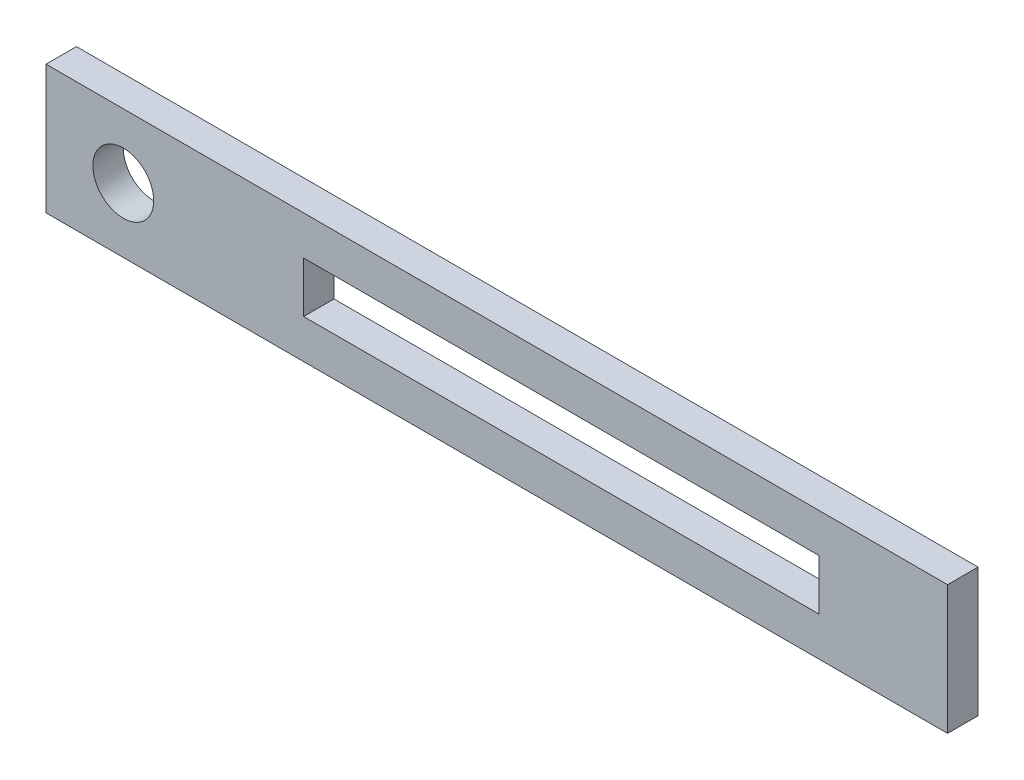
ISO-10303-21;
HEADER;
FILE_DESCRIPTION(('STEP AP214'),'2;1');
FILE_NAME('part.step','',(''),(''),'','','');
FILE_SCHEMA(('AUTOMOTIVE_DESIGN { 1 0 10303 214 1 1 1 1 }'));
ENDSEC;
DATA;
#1=APPLICATION_CONTEXT('core data for automotive mechanical design processes');
#2=APPLICATION_PROTOCOL_DEFINITION('international standard','automotive_design',2000,#1);
#3=PRODUCT_CONTEXT('',#1,'mechanical');
#4=PRODUCT('Part','Part','',(#3));
#5=PRODUCT_RELATED_PRODUCT_CATEGORY('part','',(#4));
#6=PRODUCT_DEFINITION_FORMATION('','',#4);
#7=PRODUCT_DEFINITION_CONTEXT('part definition',#1,'design');
#8=PRODUCT_DEFINITION('design','',#6,#7);
#9=PRODUCT_DEFINITION_SHAPE('','',#8);
#10=(LENGTH_UNIT() NAMED_UNIT(*) SI_UNIT(.MILLI.,.METRE.));
#11=(NAMED_UNIT(*) PLANE_ANGLE_UNIT() SI_UNIT($,.RADIAN.));
#12=(NAMED_UNIT(*) SI_UNIT($,.STERADIAN.) SOLID_ANGLE_UNIT());
#13=UNCERTAINTY_MEASURE_WITH_UNIT(LENGTH_MEASURE(1.E-05),#10,'distance_accuracy_value','');
#14=(GEOMETRIC_REPRESENTATION_CONTEXT(3) GLOBAL_UNCERTAINTY_ASSIGNED_CONTEXT((#13)) GLOBAL_UNIT_ASSIGNED_CONTEXT((#10,
#11,#12)) REPRESENTATION_CONTEXT('',''));
#15=CARTESIAN_POINT('',(0.,0.,0.));
#16=DIRECTION('',(0.,0.,1.));
#17=DIRECTION('',(1.,0.,0.));
#18=AXIS2_PLACEMENT_3D('',#15,#16,#17);
#19=CARTESIAN_POINT('',(0.,0.,1.5));
#20=DIRECTION('',(0.,0.,1.));
#21=DIRECTION('',(1.,0.,0.));
#22=AXIS2_PLACEMENT_3D('',#19,#20,#21);
#23=PLANE('',#22);
#24=DIRECTION('',(0.,-1.,0.));
#25=VECTOR('',#24,1.);
#26=CARTESIAN_POINT('',(-7.62,6.35,1.5));
#27=LINE('',#26,#25);
#28=CARTESIAN_POINT('',(-7.62,6.35,1.5));
#29=VERTEX_POINT('',#28);
#30=CARTESIAN_POINT('',(-7.62,-6.35,1.5));
#31=VERTEX_POINT('',#30);
#32=EDGE_CURVE('E139',#29,#31,#27,.T.);
#33=ORIENTED_EDGE('',*,*,#32,.T.);
#34=DIRECTION('',(1.,0.,0.));
#35=VECTOR('',#34,1.);
#36=CARTESIAN_POINT('',(-7.62,-6.35,1.5));
#37=LINE('',#36,#35);
#38=CARTESIAN_POINT('',(81.28,-6.35,1.5));
#39=VERTEX_POINT('',#38);
#40=EDGE_CURVE('E142',#31,#39,#37,.T.);
#41=ORIENTED_EDGE('',*,*,#40,.T.);
#42=DIRECTION('',(0.,1.,0.));
#43=VECTOR('',#42,1.);
#44=CARTESIAN_POINT('',(81.28,6.35,1.5));
#45=LINE('',#44,#43);
#46=CARTESIAN_POINT('',(81.28,6.35,1.5));
#47=VERTEX_POINT('',#46);
#48=EDGE_CURVE('E145',#39,#47,#45,.T.);
#49=ORIENTED_EDGE('',*,*,#48,.T.);
#50=DIRECTION('',(-1.,0.,0.));
#51=VECTOR('',#50,1.);
#52=CARTESIAN_POINT('',(-7.62,6.35,1.5));
#53=LINE('',#52,#51);
#54=EDGE_CURVE('E147',#47,#29,#53,.T.);
#55=ORIENTED_EDGE('',*,*,#54,.T.);
#56=EDGE_LOOP('',(#33,#41,#49,#55));
#57=FACE_BOUND('',#56,.T.);
#58=CARTESIAN_POINT('',(0.,0.,1.5));
#59=DIRECTION('',(0.,0.,1.));
#60=DIRECTION('',(1.,0.,0.));
#61=AXIS2_PLACEMENT_3D('',#58,#59,#60);
#62=CIRCLE('',#61,3.);
#63=CARTESIAN_POINT('',(3.,0.,1.5));
#64=VERTEX_POINT('',#63);
#65=EDGE_CURVE('E133',#64,#64,#62,.T.);
#66=ORIENTED_EDGE('',*,*,#65,.F.);
#67=EDGE_LOOP('',(#66));
#68=FACE_BOUND('',#67,.T.);
#69=DIRECTION('',(-1.,0.,0.));
#70=VECTOR('',#69,1.);
#71=CARTESIAN_POINT('',(17.78,2.5,1.5));
#72=LINE('',#71,#70);
#73=CARTESIAN_POINT('',(68.58,2.5,1.5));
#74=VERTEX_POINT('',#73);
#75=CARTESIAN_POINT('',(17.78,2.5,1.5));
#76=VERTEX_POINT('',#75);
#77=EDGE_CURVE('E105',#74,#76,#72,.T.);
#78=ORIENTED_EDGE('',*,*,#77,.F.);
#79=DIRECTION('',(0.,1.,0.));
#80=VECTOR('',#79,1.);
#81=CARTESIAN_POINT('',(68.58,2.5,1.5));
#82=LINE('',#81,#80);
#83=CARTESIAN_POINT('',(68.58,-2.5,1.5));
#84=VERTEX_POINT('',#83);
#85=EDGE_CURVE('E97',#84,#74,#82,.T.);
#86=ORIENTED_EDGE('',*,*,#85,.F.);
#87=DIRECTION('',(1.,0.,0.));
#88=VECTOR('',#87,1.);
#89=CARTESIAN_POINT('',(17.78,-2.5,1.5));
#90=LINE('',#89,#88);
#91=CARTESIAN_POINT('',(17.78,-2.5,1.5));
#92=VERTEX_POINT('',#91);
#93=EDGE_CURVE('E119',#92,#84,#90,.T.);
#94=ORIENTED_EDGE('',*,*,#93,.F.);
#95=DIRECTION('',(0.,-1.,0.));
#96=VECTOR('',#95,1.);
#97=CARTESIAN_POINT('',(17.78,2.5,1.5));
#98=LINE('',#97,#96);
#99=EDGE_CURVE('E117',#76,#92,#98,.T.);
#100=ORIENTED_EDGE('',*,*,#99,.F.);
#101=EDGE_LOOP('',(#78,#86,#94,#100));
#102=FACE_BOUND('',#101,.T.);
#103=ADVANCED_FACE('F32',(#57,#68,#102),#23,.T.);
#104=CARTESIAN_POINT('',(0.,0.,-1.5));
#105=DIRECTION('',(0.,0.,1.));
#106=DIRECTION('',(1.,0.,0.));
#107=AXIS2_PLACEMENT_3D('',#104,#105,#106);
#108=PLANE('',#107);
#109=CARTESIAN_POINT('',(0.,0.,-1.5));
#110=DIRECTION('',(0.,0.,1.));
#111=DIRECTION('',(1.,0.,0.));
#112=AXIS2_PLACEMENT_3D('',#109,#110,#111);
#113=CIRCLE('',#112,3.);
#114=CARTESIAN_POINT('',(3.,0.,-1.5));
#115=VERTEX_POINT('',#114);
#116=EDGE_CURVE('E113',#115,#115,#113,.T.);
#117=ORIENTED_EDGE('',*,*,#116,.T.);
#118=EDGE_LOOP('',(#117));
#119=FACE_BOUND('',#118,.T.);
#120=DIRECTION('',(0.,-1.,0.));
#121=VECTOR('',#120,1.);
#122=CARTESIAN_POINT('',(-7.62,6.35,-1.5));
#123=LINE('',#122,#121);
#124=CARTESIAN_POINT('',(-7.62,6.35,-1.5));
#125=VERTEX_POINT('',#124);
#126=CARTESIAN_POINT('',(-7.62,-6.35,-1.5));
#127=VERTEX_POINT('',#126);
#128=EDGE_CURVE('E136',#125,#127,#123,.T.);
#129=ORIENTED_EDGE('',*,*,#128,.F.);
#130=DIRECTION('',(-1.,0.,0.));
#131=VECTOR('',#130,1.);
#132=CARTESIAN_POINT('',(-7.62,6.35,-1.5));
#133=LINE('',#132,#131);
#134=CARTESIAN_POINT('',(81.28,6.35,-1.5));
#135=VERTEX_POINT('',#134);
#136=EDGE_CURVE('E143',#135,#125,#133,.T.);
#137=ORIENTED_EDGE('',*,*,#136,.F.);
#138=DIRECTION('',(0.,1.,0.));
#139=VECTOR('',#138,1.);
#140=CARTESIAN_POINT('',(81.28,6.35,-1.5));
#141=LINE('',#140,#139);
#142=CARTESIAN_POINT('',(81.28,-6.35,-1.5));
#143=VERTEX_POINT('',#142);
#144=EDGE_CURVE('E154',#143,#135,#141,.T.);
#145=ORIENTED_EDGE('',*,*,#144,.F.);
#146=DIRECTION('',(1.,0.,0.));
#147=VECTOR('',#146,1.);
#148=CARTESIAN_POINT('',(-7.62,-6.35,-1.5));
#149=LINE('',#148,#147);
#150=EDGE_CURVE('E152',#127,#143,#149,.T.);
#151=ORIENTED_EDGE('',*,*,#150,.F.);
#152=EDGE_LOOP('',(#129,#137,#145,#151));
#153=FACE_BOUND('',#152,.T.);
#154=DIRECTION('',(0.,1.,0.));
#155=VECTOR('',#154,1.);
#156=CARTESIAN_POINT('',(68.58,2.5,-1.5));
#157=LINE('',#156,#155);
#158=CARTESIAN_POINT('',(68.58,-2.5,-1.5));
#159=VERTEX_POINT('',#158);
#160=CARTESIAN_POINT('',(68.58,2.5,-1.5));
#161=VERTEX_POINT('',#160);
#162=EDGE_CURVE('E55',#159,#161,#157,.T.);
#163=ORIENTED_EDGE('',*,*,#162,.T.);
#164=DIRECTION('',(-1.,0.,0.));
#165=VECTOR('',#164,1.);
#166=CARTESIAN_POINT('',(17.78,2.5,-1.5));
#167=LINE('',#166,#165);
#168=CARTESIAN_POINT('',(17.78,2.5,-1.5));
#169=VERTEX_POINT('',#168);
#170=EDGE_CURVE('E112',#161,#169,#167,.T.);
#171=ORIENTED_EDGE('',*,*,#170,.T.);
#172=DIRECTION('',(0.,-1.,0.));
#173=VECTOR('',#172,1.);
#174=CARTESIAN_POINT('',(17.78,2.5,-1.5));
#175=LINE('',#174,#173);
#176=CARTESIAN_POINT('',(17.78,-2.5,-1.5));
#177=VERTEX_POINT('',#176);
#178=EDGE_CURVE('E125',#169,#177,#175,.T.);
#179=ORIENTED_EDGE('',*,*,#178,.T.);
#180=DIRECTION('',(1.,0.,0.));
#181=VECTOR('',#180,1.);
#182=CARTESIAN_POINT('',(17.78,-2.5,-1.5));
#183=LINE('',#182,#181);
#184=EDGE_CURVE('E106',#177,#159,#183,.T.);
#185=ORIENTED_EDGE('',*,*,#184,.T.);
#186=EDGE_LOOP('',(#163,#171,#179,#185));
#187=FACE_BOUND('',#186,.T.);
#188=ADVANCED_FACE('F172',(#119,#153,#187),#108,.F.);
#189=CARTESIAN_POINT('',(-7.62,6.35,1.5));
#190=DIRECTION('',(1.,0.,0.));
#191=DIRECTION('',(0.,0.,-1.));
#192=AXIS2_PLACEMENT_3D('',#189,#190,#191);
#193=PLANE('',#192);
#194=ORIENTED_EDGE('',*,*,#128,.T.);
#195=DIRECTION('',(0.,0.,-1.));
#196=VECTOR('',#195,1.);
#197=CARTESIAN_POINT('',(-7.62,-6.35,1.5));
#198=LINE('',#197,#196);
#199=EDGE_CURVE('E11',#31,#127,#198,.T.);
#200=ORIENTED_EDGE('',*,*,#199,.F.);
#201=ORIENTED_EDGE('',*,*,#32,.F.);
#202=DIRECTION('',(0.,0.,-1.));
#203=VECTOR('',#202,1.);
#204=CARTESIAN_POINT('',(-7.62,6.35,1.5));
#205=LINE('',#204,#203);
#206=EDGE_CURVE('E149',#29,#125,#205,.T.);
#207=ORIENTED_EDGE('',*,*,#206,.T.);
#208=EDGE_LOOP('',(#194,#200,#201,#207));
#209=FACE_BOUND('',#208,.T.);
#210=ADVANCED_FACE('F34',(#209),#193,.F.);
#211=CARTESIAN_POINT('',(-7.62,-6.35,1.5));
#212=DIRECTION('',(0.,1.,0.));
#213=DIRECTION('',(0.,0.,1.));
#214=AXIS2_PLACEMENT_3D('',#211,#212,#213);
#215=PLANE('',#214);
#216=ORIENTED_EDGE('',*,*,#150,.T.);
#217=DIRECTION('',(0.,0.,-1.));
#218=VECTOR('',#217,1.);
#219=CARTESIAN_POINT('',(81.28,-6.35,1.5));
#220=LINE('',#219,#218);
#221=EDGE_CURVE('E40',#39,#143,#220,.T.);
#222=ORIENTED_EDGE('',*,*,#221,.F.);
#223=ORIENTED_EDGE('',*,*,#40,.F.);
#224=ORIENTED_EDGE('',*,*,#199,.T.);
#225=EDGE_LOOP('',(#216,#222,#223,#224));
#226=FACE_BOUND('',#225,.T.);
#227=ADVANCED_FACE('F183',(#226),#215,.F.);
#228=CARTESIAN_POINT('',(81.28,6.35,1.5));
#229=DIRECTION('',(-1.,0.,0.));
#230=DIRECTION('',(0.,0.,1.));
#231=AXIS2_PLACEMENT_3D('',#228,#229,#230);
#232=PLANE('',#231);
#233=ORIENTED_EDGE('',*,*,#144,.T.);
#234=DIRECTION('',(0.,0.,-1.));
#235=VECTOR('',#234,1.);
#236=CARTESIAN_POINT('',(81.28,6.35,1.5));
#237=LINE('',#236,#235);
#238=EDGE_CURVE('E159',#47,#135,#237,.T.);
#239=ORIENTED_EDGE('',*,*,#238,.F.);
#240=ORIENTED_EDGE('',*,*,#48,.F.);
#241=ORIENTED_EDGE('',*,*,#221,.T.);
#242=EDGE_LOOP('',(#233,#239,#240,#241));
#243=FACE_BOUND('',#242,.T.);
#244=ADVANCED_FACE('F166',(#243),#232,.F.);
#245=CARTESIAN_POINT('',(-7.62,6.35,1.5));
#246=DIRECTION('',(0.,-1.,0.));
#247=DIRECTION('',(0.,0.,-1.));
#248=AXIS2_PLACEMENT_3D('',#245,#246,#247);
#249=PLANE('',#248);
#250=ORIENTED_EDGE('',*,*,#136,.T.);
#251=ORIENTED_EDGE('',*,*,#206,.F.);
#252=ORIENTED_EDGE('',*,*,#54,.F.);
#253=ORIENTED_EDGE('',*,*,#238,.T.);
#254=EDGE_LOOP('',(#250,#251,#252,#253));
#255=FACE_BOUND('',#254,.T.);
#256=ADVANCED_FACE('F176',(#255),#249,.F.);
#257=CARTESIAN_POINT('',(0.,0.,1.5));
#258=DIRECTION('',(0.,0.,-1.));
#259=DIRECTION('',(-1.,0.,0.));
#260=AXIS2_PLACEMENT_3D('',#257,#258,#259);
#261=CYLINDRICAL_SURFACE('',#260,3.);
#262=ORIENTED_EDGE('',*,*,#65,.T.);
#263=EDGE_LOOP('',(#262));
#264=FACE_BOUND('',#263,.T.);
#265=ORIENTED_EDGE('',*,*,#116,.F.);
#266=EDGE_LOOP('',(#265));
#267=FACE_BOUND('',#266,.T.);
#268=ADVANCED_FACE('F198',(#264,#267),#261,.F.);
#269=CARTESIAN_POINT('',(68.58,2.5,1.5));
#270=DIRECTION('',(-1.,0.,0.));
#271=DIRECTION('',(0.,0.,1.));
#272=AXIS2_PLACEMENT_3D('',#269,#270,#271);
#273=PLANE('',#272);
#274=ORIENTED_EDGE('',*,*,#162,.F.);
#275=DIRECTION('',(0.,0.,-1.));
#276=VECTOR('',#275,1.);
#277=CARTESIAN_POINT('',(68.58,-2.5,1.5));
#278=LINE('',#277,#276);
#279=EDGE_CURVE('E101',#84,#159,#278,.T.);
#280=ORIENTED_EDGE('',*,*,#279,.F.);
#281=ORIENTED_EDGE('',*,*,#85,.T.);
#282=DIRECTION('',(0.,0.,-1.));
#283=VECTOR('',#282,1.);
#284=CARTESIAN_POINT('',(68.58,2.5,1.5));
#285=LINE('',#284,#283);
#286=EDGE_CURVE('E100',#74,#161,#285,.T.);
#287=ORIENTED_EDGE('',*,*,#286,.T.);
#288=EDGE_LOOP('',(#274,#280,#281,#287));
#289=FACE_BOUND('',#288,.T.);
#290=ADVANCED_FACE('F99',(#289),#273,.T.);
#291=CARTESIAN_POINT('',(17.78,2.5,1.5));
#292=DIRECTION('',(0.,-1.,0.));
#293=DIRECTION('',(0.,0.,-1.));
#294=AXIS2_PLACEMENT_3D('',#291,#292,#293);
#295=PLANE('',#294);
#296=ORIENTED_EDGE('',*,*,#170,.F.);
#297=ORIENTED_EDGE('',*,*,#286,.F.);
#298=ORIENTED_EDGE('',*,*,#77,.T.);
#299=DIRECTION('',(0.,0.,-1.));
#300=VECTOR('',#299,1.);
#301=CARTESIAN_POINT('',(17.78,2.5,1.5));
#302=LINE('',#301,#300);
#303=EDGE_CURVE('E114',#76,#169,#302,.T.);
#304=ORIENTED_EDGE('',*,*,#303,.T.);
#305=EDGE_LOOP('',(#296,#297,#298,#304));
#306=FACE_BOUND('',#305,.T.);
#307=ADVANCED_FACE('F109',(#306),#295,.T.);
#308=CARTESIAN_POINT('',(17.78,2.5,1.5));
#309=DIRECTION('',(1.,0.,0.));
#310=DIRECTION('',(0.,0.,-1.));
#311=AXIS2_PLACEMENT_3D('',#308,#309,#310);
#312=PLANE('',#311);
#313=ORIENTED_EDGE('',*,*,#178,.F.);
#314=ORIENTED_EDGE('',*,*,#303,.F.);
#315=ORIENTED_EDGE('',*,*,#99,.T.);
#316=DIRECTION('',(0.,0.,-1.));
#317=VECTOR('',#316,1.);
#318=CARTESIAN_POINT('',(17.78,-2.5,1.5));
#319=LINE('',#318,#317);
#320=EDGE_CURVE('E47',#92,#177,#319,.T.);
#321=ORIENTED_EDGE('',*,*,#320,.T.);
#322=EDGE_LOOP('',(#313,#314,#315,#321));
#323=FACE_BOUND('',#322,.T.);
#324=ADVANCED_FACE('F215',(#323),#312,.T.);
#325=CARTESIAN_POINT('',(17.78,-2.5,1.5));
#326=DIRECTION('',(0.,1.,0.));
#327=DIRECTION('',(0.,0.,1.));
#328=AXIS2_PLACEMENT_3D('',#325,#326,#327);
#329=PLANE('',#328);
#330=ORIENTED_EDGE('',*,*,#184,.F.);
#331=ORIENTED_EDGE('',*,*,#320,.F.);
#332=ORIENTED_EDGE('',*,*,#93,.T.);
#333=ORIENTED_EDGE('',*,*,#279,.T.);
#334=EDGE_LOOP('',(#330,#331,#332,#333));
#335=FACE_BOUND('',#334,.T.);
#336=ADVANCED_FACE('F220',(#335),#329,.T.);
#337=CLOSED_SHELL('',(#103,#188,#210,#227,#244,#256,#268,#290,#307,#324,#336));
#338=MANIFOLD_SOLID_BREP('B2',#337);
#339=ADVANCED_BREP_SHAPE_REPRESENTATION('',(#18,#338),#14);
#340=SHAPE_DEFINITION_REPRESENTATION(#9,#339);
ENDSEC;
END-ISO-10303-21;
